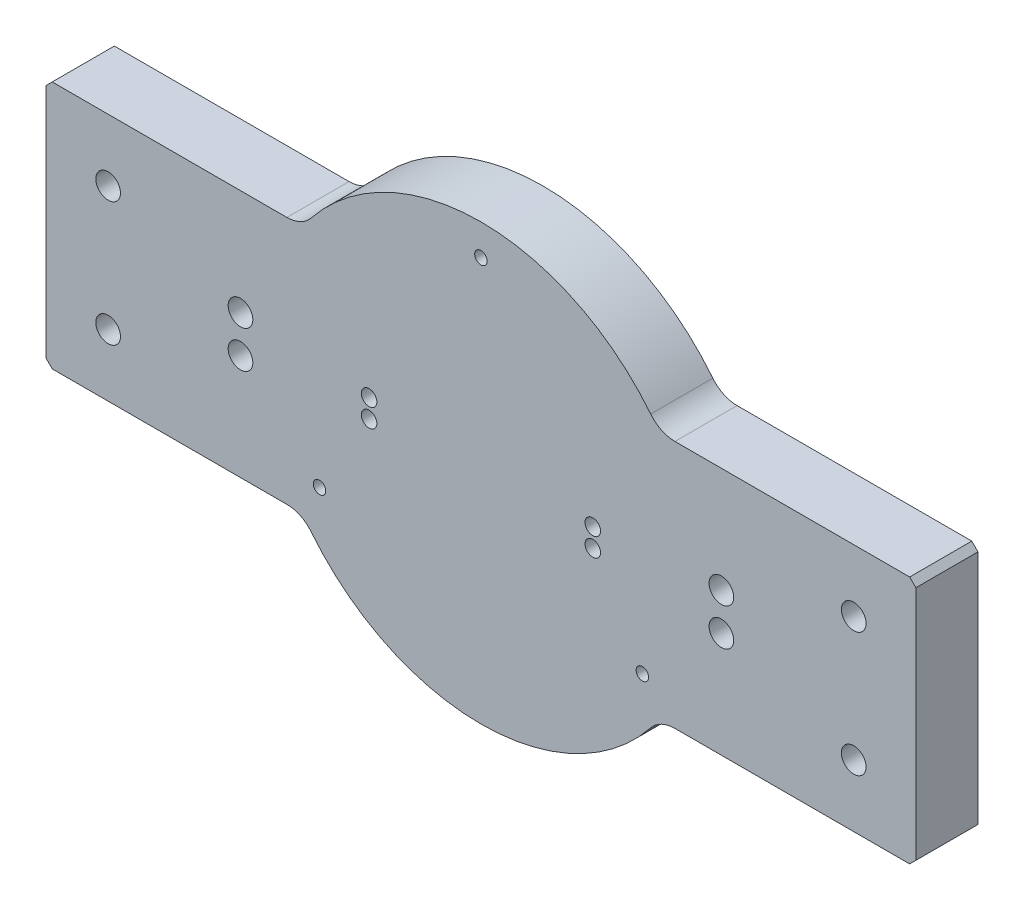
ISO-10303-21;
HEADER;
FILE_DESCRIPTION(('STEP AP214'),'2;1');
FILE_NAME('part.step','',(''),(''),'','','');
FILE_SCHEMA(('AUTOMOTIVE_DESIGN { 1 0 10303 214 1 1 1 1 }'));
ENDSEC;
DATA;
#1=APPLICATION_CONTEXT('core data for automotive mechanical design processes');
#2=APPLICATION_PROTOCOL_DEFINITION('international standard','automotive_design',2000,#1);
#3=PRODUCT_CONTEXT('',#1,'mechanical');
#4=PRODUCT('Part','Part','',(#3));
#5=PRODUCT_RELATED_PRODUCT_CATEGORY('part','',(#4));
#6=PRODUCT_DEFINITION_FORMATION('','',#4);
#7=PRODUCT_DEFINITION_CONTEXT('part definition',#1,'design');
#8=PRODUCT_DEFINITION('design','',#6,#7);
#9=PRODUCT_DEFINITION_SHAPE('','',#8);
#10=(LENGTH_UNIT() NAMED_UNIT(*) SI_UNIT(.MILLI.,.METRE.));
#11=(NAMED_UNIT(*) PLANE_ANGLE_UNIT() SI_UNIT($,.RADIAN.));
#12=(NAMED_UNIT(*) SI_UNIT($,.STERADIAN.) SOLID_ANGLE_UNIT());
#13=UNCERTAINTY_MEASURE_WITH_UNIT(LENGTH_MEASURE(1.E-05),#10,'distance_accuracy_value','');
#14=(GEOMETRIC_REPRESENTATION_CONTEXT(3) GLOBAL_UNCERTAINTY_ASSIGNED_CONTEXT((#13)) GLOBAL_UNIT_ASSIGNED_CONTEXT((#10,
#11,#12)) REPRESENTATION_CONTEXT('',''));
#15=CARTESIAN_POINT('',(0.,0.,0.));
#16=DIRECTION('',(0.,0.,1.));
#17=DIRECTION('',(1.,0.,0.));
#18=AXIS2_PLACEMENT_3D('',#15,#16,#17);
#19=CARTESIAN_POINT('',(177.8,50.8,25.4));
#20=DIRECTION('',(0.,0.,-1.));
#21=DIRECTION('',(-1.,0.,0.));
#22=AXIS2_PLACEMENT_3D('',#19,#20,#21);
#23=PLANE('',#22);
#24=CARTESIAN_POINT('',(45.72,-3.81,25.4));
#25=DIRECTION('',(0.,0.,1.));
#26=DIRECTION('',(1.,0.,0.));
#27=AXIS2_PLACEMENT_3D('',#24,#25,#26);
#28=CIRCLE('',#27,3.175);
#29=CARTESIAN_POINT('',(48.895,-3.81,25.4));
#30=VERTEX_POINT('',#29);
#31=EDGE_CURVE('E446',#30,#30,#28,.T.);
#32=ORIENTED_EDGE('',*,*,#31,.F.);
#33=EDGE_LOOP('',(#32));
#34=FACE_BOUND('',#33,.T.);
#35=CARTESIAN_POINT('',(45.72,3.81,25.4));
#36=DIRECTION('',(0.,0.,1.));
#37=DIRECTION('',(1.,0.,0.));
#38=AXIS2_PLACEMENT_3D('',#35,#36,#37);
#39=CIRCLE('',#38,3.175);
#40=CARTESIAN_POINT('',(48.895,3.81,25.4));
#41=VERTEX_POINT('',#40);
#42=EDGE_CURVE('E443',#41,#41,#39,.T.);
#43=ORIENTED_EDGE('',*,*,#42,.F.);
#44=EDGE_LOOP('',(#43));
#45=FACE_BOUND('',#44,.T.);
#46=CARTESIAN_POINT('',(152.399999999999,25.4,25.4));
#47=DIRECTION('',(0.,0.,1.));
#48=DIRECTION('',(1.,0.,0.));
#49=AXIS2_PLACEMENT_3D('',#46,#47,#48);
#50=CIRCLE('',#49,5.04189999999999);
#51=CARTESIAN_POINT('',(157.441899999999,25.4,25.4));
#52=VERTEX_POINT('',#51);
#53=EDGE_CURVE('E431',#52,#52,#50,.T.);
#54=ORIENTED_EDGE('',*,*,#53,.F.);
#55=EDGE_LOOP('',(#54));
#56=FACE_BOUND('',#55,.T.);
#57=CARTESIAN_POINT('',(-98.2979999999999,-7.62000000000009,25.4));
#58=DIRECTION('',(0.,0.,1.));
#59=DIRECTION('',(1.,0.,0.));
#60=AXIS2_PLACEMENT_3D('',#57,#58,#59);
#61=CIRCLE('',#60,5.04189999999999);
#62=CARTESIAN_POINT('',(-93.2560999999999,-7.62000000000009,25.4));
#63=VERTEX_POINT('',#62);
#64=EDGE_CURVE('E267',#63,#63,#61,.T.);
#65=ORIENTED_EDGE('',*,*,#64,.F.);
#66=EDGE_LOOP('',(#65));
#67=FACE_BOUND('',#66,.T.);
#68=CARTESIAN_POINT('',(-98.2979999999999,7.61999999999991,25.4));
#69=DIRECTION('',(0.,0.,1.));
#70=DIRECTION('',(1.,0.,0.));
#71=AXIS2_PLACEMENT_3D('',#68,#69,#70);
#72=CIRCLE('',#71,5.04189999999999);
#73=CARTESIAN_POINT('',(-93.2560999999999,7.61999999999991,25.4));
#74=VERTEX_POINT('',#73);
#75=EDGE_CURVE('E260',#74,#74,#72,.T.);
#76=ORIENTED_EDGE('',*,*,#75,.F.);
#77=EDGE_LOOP('',(#76));
#78=FACE_BOUND('',#77,.T.);
#79=DIRECTION('',(1.,0.,0.));
#80=VECTOR('',#79,1.);
#81=CARTESIAN_POINT('',(-177.8,-50.8,25.4));
#82=LINE('',#81,#80);
#83=CARTESIAN_POINT('',(79.3114745796596,-50.8,25.4));
#84=VERTEX_POINT('',#83);
#85=CARTESIAN_POINT('',(175.26,-50.8,25.4));
#86=VERTEX_POINT('',#85);
#87=EDGE_CURVE('E368',#84,#86,#82,.T.);
#88=ORIENTED_EDGE('',*,*,#87,.T.);
#89=DIRECTION('',(-0.707106781186548,-0.707106781186548,0.));
#90=VECTOR('',#89,1.);
#91=CARTESIAN_POINT('',(177.8,-48.26,25.4));
#92=LINE('',#91,#90);
#93=CARTESIAN_POINT('',(177.8,-48.26,25.4));
#94=VERTEX_POINT('',#93);
#95=EDGE_CURVE('E228',#86,#94,#92,.F.);
#96=ORIENTED_EDGE('',*,*,#95,.T.);
#97=DIRECTION('',(0.,1.,0.));
#98=VECTOR('',#97,1.);
#99=CARTESIAN_POINT('',(177.8,-50.8,25.4));
#100=LINE('',#99,#98);
#101=CARTESIAN_POINT('',(177.8,48.26,25.4));
#102=VERTEX_POINT('',#101);
#103=EDGE_CURVE('E167',#94,#102,#100,.T.);
#104=ORIENTED_EDGE('',*,*,#103,.T.);
#105=DIRECTION('',(0.707106781186548,-0.707106781186548,0.));
#106=VECTOR('',#105,1.);
#107=CARTESIAN_POINT('',(175.26,50.8,25.4));
#108=LINE('',#107,#106);
#109=CARTESIAN_POINT('',(175.26,50.8,25.4));
#110=VERTEX_POINT('',#109);
#111=EDGE_CURVE('E223',#102,#110,#108,.F.);
#112=ORIENTED_EDGE('',*,*,#111,.T.);
#113=DIRECTION('',(-1.,0.,0.));
#114=VECTOR('',#113,1.);
#115=CARTESIAN_POINT('',(-177.8,50.8,25.4));
#116=LINE('',#115,#114);
#117=CARTESIAN_POINT('',(79.3114745796596,50.8,25.4));
#118=VERTEX_POINT('',#117);
#119=EDGE_CURVE('E166',#110,#118,#116,.T.);
#120=ORIENTED_EDGE('',*,*,#119,.T.);
#121=CARTESIAN_POINT('',(79.3114745796597,63.5,25.4));
#122=DIRECTION('',(0.,0.,-1.));
#123=DIRECTION('',(-1.,0.,0.));
#124=AXIS2_PLACEMENT_3D('',#121,#122,#123);
#125=CIRCLE('',#124,12.7);
#126=CARTESIAN_POINT('',(69.3975402572022,55.5625,25.4));
#127=VERTEX_POINT('',#126);
#128=EDGE_CURVE('E156',#118,#127,#125,.T.);
#129=ORIENTED_EDGE('',*,*,#128,.T.);
#130=CARTESIAN_POINT('',(0.,0.,25.4));
#131=DIRECTION('',(0.,0.,1.));
#132=DIRECTION('',(1.,0.,0.));
#133=AXIS2_PLACEMENT_3D('',#130,#131,#132);
#134=CIRCLE('',#133,88.9);
#135=CARTESIAN_POINT('',(-69.3975402572022,55.5625,25.4));
#136=VERTEX_POINT('',#135);
#137=EDGE_CURVE('E152',#127,#136,#134,.T.);
#138=ORIENTED_EDGE('',*,*,#137,.T.);
#139=CARTESIAN_POINT('',(-79.3114745796597,63.5,25.4));
#140=DIRECTION('',(0.,0.,-1.));
#141=DIRECTION('',(-1.,0.,0.));
#142=AXIS2_PLACEMENT_3D('',#139,#140,#141);
#143=CIRCLE('',#142,12.7);
#144=CARTESIAN_POINT('',(-79.3114745796597,50.8,25.4));
#145=VERTEX_POINT('',#144);
#146=EDGE_CURVE('E146',#136,#145,#143,.T.);
#147=ORIENTED_EDGE('',*,*,#146,.T.);
#148=CARTESIAN_POINT('',(-175.26,50.8,25.4));
#149=VERTEX_POINT('',#148);
#150=EDGE_CURVE('E150',#145,#149,#116,.T.);
#151=ORIENTED_EDGE('',*,*,#150,.T.);
#152=DIRECTION('',(0.707106781186548,0.707106781186548,0.));
#153=VECTOR('',#152,1.);
#154=CARTESIAN_POINT('',(-177.8,48.2599999999999,25.4));
#155=LINE('',#154,#153);
#156=CARTESIAN_POINT('',(-177.8,48.2599999999999,25.4));
#157=VERTEX_POINT('',#156);
#158=EDGE_CURVE('E54',#149,#157,#155,.F.);
#159=ORIENTED_EDGE('',*,*,#158,.T.);
#160=DIRECTION('',(0.,-1.,0.));
#161=VECTOR('',#160,1.);
#162=CARTESIAN_POINT('',(-177.8,-50.8,25.4));
#163=LINE('',#162,#161);
#164=CARTESIAN_POINT('',(-177.8,-48.2600000000001,25.4));
#165=VERTEX_POINT('',#164);
#166=EDGE_CURVE('E240',#157,#165,#163,.T.);
#167=ORIENTED_EDGE('',*,*,#166,.T.);
#168=DIRECTION('',(-0.707106781186548,0.707106781186548,0.));
#169=VECTOR('',#168,1.);
#170=CARTESIAN_POINT('',(-175.26,-50.8,25.4));
#171=LINE('',#170,#169);
#172=CARTESIAN_POINT('',(-175.26,-50.8,25.4));
#173=VERTEX_POINT('',#172);
#174=EDGE_CURVE('E226',#165,#173,#171,.F.);
#175=ORIENTED_EDGE('',*,*,#174,.T.);
#176=CARTESIAN_POINT('',(-79.3114745796597,-50.8,25.4));
#177=VERTEX_POINT('',#176);
#178=EDGE_CURVE('E261',#173,#177,#82,.T.);
#179=ORIENTED_EDGE('',*,*,#178,.T.);
#180=CARTESIAN_POINT('',(-79.3114745796597,-63.5,25.4));
#181=DIRECTION('',(0.,0.,-1.));
#182=DIRECTION('',(-1.,0.,0.));
#183=AXIS2_PLACEMENT_3D('',#180,#181,#182);
#184=CIRCLE('',#183,12.7);
#185=CARTESIAN_POINT('',(-69.3975402572022,-55.5625,25.4));
#186=VERTEX_POINT('',#185);
#187=EDGE_CURVE('E203',#177,#186,#184,.T.);
#188=ORIENTED_EDGE('',*,*,#187,.T.);
#189=CARTESIAN_POINT('',(69.3975402572022,-55.5625,25.4));
#190=VERTEX_POINT('',#189);
#191=EDGE_CURVE('E383',#186,#190,#134,.T.);
#192=ORIENTED_EDGE('',*,*,#191,.T.);
#193=CARTESIAN_POINT('',(79.3114745796597,-63.5,25.4));
#194=DIRECTION('',(0.,0.,-1.));
#195=DIRECTION('',(-1.,0.,0.));
#196=AXIS2_PLACEMENT_3D('',#193,#194,#195);
#197=CIRCLE('',#196,12.7);
#198=EDGE_CURVE('E201',#190,#84,#197,.T.);
#199=ORIENTED_EDGE('',*,*,#198,.T.);
#200=EDGE_LOOP('',(#88,#96,#104,#112,#120,#129,#138,#147,#151,#159,#167,#175,#179,#188,#192,#199));
#201=FACE_BOUND('',#200,.T.);
#202=CARTESIAN_POINT('',(0.,76.2,25.4));
#203=DIRECTION('',(0.,0.,-1.));
#204=DIRECTION('',(-1.,0.,0.));
#205=AXIS2_PLACEMENT_3D('',#202,#203,#204);
#206=CIRCLE('',#205,2.55269999999999);
#207=CARTESIAN_POINT('',(-2.55269999999999,76.2,25.4));
#208=VERTEX_POINT('',#207);
#209=EDGE_CURVE('E386',#208,#208,#206,.T.);
#210=ORIENTED_EDGE('',*,*,#209,.T.);
#211=EDGE_LOOP('',(#210));
#212=FACE_BOUND('',#211,.T.);
#213=CARTESIAN_POINT('',(-65.9911357683741,-38.1000000000003,25.4));
#214=DIRECTION('',(0.,0.,-1.));
#215=DIRECTION('',(-1.,0.,0.));
#216=AXIS2_PLACEMENT_3D('',#213,#214,#215);
#217=CIRCLE('',#216,2.55269999999999);
#218=CARTESIAN_POINT('',(-68.5438357683741,-38.1000000000003,25.4));
#219=VERTEX_POINT('',#218);
#220=EDGE_CURVE('E392',#219,#219,#217,.T.);
#221=ORIENTED_EDGE('',*,*,#220,.T.);
#222=EDGE_LOOP('',(#221));
#223=FACE_BOUND('',#222,.T.);
#224=CARTESIAN_POINT('',(65.9911357683746,-38.0999999999994,25.4));
#225=DIRECTION('',(0.,0.,-1.));
#226=DIRECTION('',(-1.,0.,0.));
#227=AXIS2_PLACEMENT_3D('',#224,#225,#226);
#228=CIRCLE('',#227,2.55269999999999);
#229=CARTESIAN_POINT('',(63.4384357683746,-38.0999999999994,25.4));
#230=VERTEX_POINT('',#229);
#231=EDGE_CURVE('E398',#230,#230,#228,.T.);
#232=ORIENTED_EDGE('',*,*,#231,.T.);
#233=EDGE_LOOP('',(#232));
#234=FACE_BOUND('',#233,.T.);
#235=CARTESIAN_POINT('',(98.2980000000001,7.61999999999991,25.4));
#236=DIRECTION('',(0.,0.,1.));
#237=DIRECTION('',(1.,0.,0.));
#238=AXIS2_PLACEMENT_3D('',#235,#236,#237);
#239=CIRCLE('',#238,5.04189999999999);
#240=CARTESIAN_POINT('',(103.3399,7.61999999999991,25.4));
#241=VERTEX_POINT('',#240);
#242=EDGE_CURVE('E407',#241,#241,#239,.T.);
#243=ORIENTED_EDGE('',*,*,#242,.F.);
#244=EDGE_LOOP('',(#243));
#245=FACE_BOUND('',#244,.T.);
#246=CARTESIAN_POINT('',(98.2980000000001,-7.62000000000009,25.4));
#247=DIRECTION('',(0.,0.,1.));
#248=DIRECTION('',(1.,0.,0.));
#249=AXIS2_PLACEMENT_3D('',#246,#247,#248);
#250=CIRCLE('',#249,5.04189999999999);
#251=CARTESIAN_POINT('',(103.3399,-7.62000000000009,25.4));
#252=VERTEX_POINT('',#251);
#253=EDGE_CURVE('E410',#252,#252,#250,.T.);
#254=ORIENTED_EDGE('',*,*,#253,.F.);
#255=EDGE_LOOP('',(#254));
#256=FACE_BOUND('',#255,.T.);
#257=CARTESIAN_POINT('',(-152.4,25.4,25.4));
#258=DIRECTION('',(0.,0.,1.));
#259=DIRECTION('',(1.,0.,0.));
#260=AXIS2_PLACEMENT_3D('',#257,#258,#259);
#261=CIRCLE('',#260,5.04189999999999);
#262=CARTESIAN_POINT('',(-147.3581,25.4,25.4));
#263=VERTEX_POINT('',#262);
#264=EDGE_CURVE('E419',#263,#263,#261,.T.);
#265=ORIENTED_EDGE('',*,*,#264,.F.);
#266=EDGE_LOOP('',(#265));
#267=FACE_BOUND('',#266,.T.);
#268=CARTESIAN_POINT('',(-152.4,-25.4,25.4));
#269=DIRECTION('',(0.,0.,1.));
#270=DIRECTION('',(1.,0.,0.));
#271=AXIS2_PLACEMENT_3D('',#268,#269,#270);
#272=CIRCLE('',#271,5.04189999999999);
#273=CARTESIAN_POINT('',(-147.3581,-25.4,25.4));
#274=VERTEX_POINT('',#273);
#275=EDGE_CURVE('E425',#274,#274,#272,.T.);
#276=ORIENTED_EDGE('',*,*,#275,.F.);
#277=EDGE_LOOP('',(#276));
#278=FACE_BOUND('',#277,.T.);
#279=CARTESIAN_POINT('',(152.399999999999,-25.4,25.4));
#280=DIRECTION('',(0.,0.,1.));
#281=DIRECTION('',(1.,0.,0.));
#282=AXIS2_PLACEMENT_3D('',#279,#280,#281);
#283=CIRCLE('',#282,5.04189999999999);
#284=CARTESIAN_POINT('',(157.441899999999,-25.4,25.4));
#285=VERTEX_POINT('',#284);
#286=EDGE_CURVE('E437',#285,#285,#283,.T.);
#287=ORIENTED_EDGE('',*,*,#286,.F.);
#288=EDGE_LOOP('',(#287));
#289=FACE_BOUND('',#288,.T.);
#290=CARTESIAN_POINT('',(-45.72,3.81,25.4));
#291=DIRECTION('',(0.,0.,1.));
#292=DIRECTION('',(1.,0.,0.));
#293=AXIS2_PLACEMENT_3D('',#290,#291,#292);
#294=CIRCLE('',#293,3.175);
#295=CARTESIAN_POINT('',(-42.545,3.81,25.4));
#296=VERTEX_POINT('',#295);
#297=EDGE_CURVE('E273',#296,#296,#294,.T.);
#298=ORIENTED_EDGE('',*,*,#297,.F.);
#299=EDGE_LOOP('',(#298));
#300=FACE_BOUND('',#299,.T.);
#301=CARTESIAN_POINT('',(-45.72,-3.81,25.4));
#302=DIRECTION('',(0.,0.,1.));
#303=DIRECTION('',(1.,0.,0.));
#304=AXIS2_PLACEMENT_3D('',#301,#302,#303);
#305=CIRCLE('',#304,3.175);
#306=CARTESIAN_POINT('',(-42.545,-3.81,25.4));
#307=VERTEX_POINT('',#306);
#308=EDGE_CURVE('E171',#307,#307,#305,.T.);
#309=ORIENTED_EDGE('',*,*,#308,.F.);
#310=EDGE_LOOP('',(#309));
#311=FACE_BOUND('',#310,.T.);
#312=ADVANCED_FACE('F32',(#34,#45,#56,#67,#78,#201,#212,#223,#234,#245,#256,#267,#278,#289,#300,
#311),#23,.F.);
#313=CARTESIAN_POINT('',(177.8,50.8,0.));
#314=DIRECTION('',(0.,0.,-1.));
#315=DIRECTION('',(-1.,0.,0.));
#316=AXIS2_PLACEMENT_3D('',#313,#314,#315);
#317=PLANE('',#316);
#318=CARTESIAN_POINT('',(45.72,-3.81,0.));
#319=DIRECTION('',(0.,0.,1.));
#320=DIRECTION('',(1.,0.,0.));
#321=AXIS2_PLACEMENT_3D('',#318,#319,#320);
#322=CIRCLE('',#321,3.175);
#323=CARTESIAN_POINT('',(48.895,-3.81,0.));
#324=VERTEX_POINT('',#323);
#325=EDGE_CURVE('E449',#324,#324,#322,.T.);
#326=ORIENTED_EDGE('',*,*,#325,.T.);
#327=EDGE_LOOP('',(#326));
#328=FACE_BOUND('',#327,.T.);
#329=CARTESIAN_POINT('',(45.72,3.81,0.));
#330=DIRECTION('',(0.,0.,1.));
#331=DIRECTION('',(1.,0.,0.));
#332=AXIS2_PLACEMENT_3D('',#329,#330,#331);
#333=CIRCLE('',#332,3.175);
#334=CARTESIAN_POINT('',(48.895,3.81,0.));
#335=VERTEX_POINT('',#334);
#336=EDGE_CURVE('E440',#335,#335,#333,.T.);
#337=ORIENTED_EDGE('',*,*,#336,.T.);
#338=EDGE_LOOP('',(#337));
#339=FACE_BOUND('',#338,.T.);
#340=CARTESIAN_POINT('',(152.399999999999,25.4,0.));
#341=DIRECTION('',(0.,0.,1.));
#342=DIRECTION('',(1.,0.,0.));
#343=AXIS2_PLACEMENT_3D('',#340,#341,#342);
#344=CIRCLE('',#343,5.04189999999999);
#345=CARTESIAN_POINT('',(157.441899999999,25.4,0.));
#346=VERTEX_POINT('',#345);
#347=EDGE_CURVE('E428',#346,#346,#344,.T.);
#348=ORIENTED_EDGE('',*,*,#347,.T.);
#349=EDGE_LOOP('',(#348));
#350=FACE_BOUND('',#349,.T.);
#351=CARTESIAN_POINT('',(-98.2979999999999,-7.62000000000009,0.));
#352=DIRECTION('',(0.,0.,1.));
#353=DIRECTION('',(1.,0.,0.));
#354=AXIS2_PLACEMENT_3D('',#351,#352,#353);
#355=CIRCLE('',#354,5.04189999999999);
#356=CARTESIAN_POINT('',(-93.2560999999999,-7.62000000000009,0.));
#357=VERTEX_POINT('',#356);
#358=EDGE_CURVE('E264',#357,#357,#355,.T.);
#359=ORIENTED_EDGE('',*,*,#358,.T.);
#360=EDGE_LOOP('',(#359));
#361=FACE_BOUND('',#360,.T.);
#362=CARTESIAN_POINT('',(-98.2979999999999,7.61999999999991,0.));
#363=DIRECTION('',(0.,0.,1.));
#364=DIRECTION('',(1.,0.,0.));
#365=AXIS2_PLACEMENT_3D('',#362,#363,#364);
#366=CIRCLE('',#365,5.04189999999999);
#367=CARTESIAN_POINT('',(-93.2560999999999,7.61999999999991,0.));
#368=VERTEX_POINT('',#367);
#369=EDGE_CURVE('E257',#368,#368,#366,.T.);
#370=ORIENTED_EDGE('',*,*,#369,.T.);
#371=EDGE_LOOP('',(#370));
#372=FACE_BOUND('',#371,.T.);
#373=DIRECTION('',(0.,1.,0.));
#374=VECTOR('',#373,1.);
#375=CARTESIAN_POINT('',(177.8,-50.8,0.));
#376=LINE('',#375,#374);
#377=CARTESIAN_POINT('',(177.8,-48.26,0.));
#378=VERTEX_POINT('',#377);
#379=CARTESIAN_POINT('',(177.8,48.2600000000001,0.));
#380=VERTEX_POINT('',#379);
#381=EDGE_CURVE('E373',#378,#380,#376,.T.);
#382=ORIENTED_EDGE('',*,*,#381,.F.);
#383=DIRECTION('',(0.707106781186548,0.707106781186548,0.));
#384=VECTOR('',#383,1.);
#385=CARTESIAN_POINT('',(227.33,1.26999999999999,0.));
#386=LINE('',#385,#384);
#387=CARTESIAN_POINT('',(175.26,-50.8,0.));
#388=VERTEX_POINT('',#387);
#389=EDGE_CURVE('E219',#378,#388,#386,.F.);
#390=ORIENTED_EDGE('',*,*,#389,.T.);
#391=DIRECTION('',(1.,0.,0.));
#392=VECTOR('',#391,1.);
#393=CARTESIAN_POINT('',(-177.8,-50.8,0.));
#394=LINE('',#393,#392);
#395=CARTESIAN_POINT('',(79.3114745796596,-50.8,0.));
#396=VERTEX_POINT('',#395);
#397=EDGE_CURVE('E247',#396,#388,#394,.T.);
#398=ORIENTED_EDGE('',*,*,#397,.F.);
#399=CARTESIAN_POINT('',(79.3114745796597,-63.5,0.));
#400=DIRECTION('',(0.,0.,-1.));
#401=DIRECTION('',(-1.,0.,0.));
#402=AXIS2_PLACEMENT_3D('',#399,#400,#401);
#403=CIRCLE('',#402,12.7);
#404=CARTESIAN_POINT('',(69.3975402572022,-55.5625,0.));
#405=VERTEX_POINT('',#404);
#406=EDGE_CURVE('E199',#396,#405,#403,.F.);
#407=ORIENTED_EDGE('',*,*,#406,.T.);
#408=CARTESIAN_POINT('',(0.,0.,0.));
#409=DIRECTION('',(0.,0.,-1.));
#410=DIRECTION('',(-1.,0.,0.));
#411=AXIS2_PLACEMENT_3D('',#408,#409,#410);
#412=CIRCLE('',#411,88.9);
#413=CARTESIAN_POINT('',(-69.3975402572022,-55.5625,0.));
#414=VERTEX_POINT('',#413);
#415=EDGE_CURVE('E375',#414,#405,#412,.F.);
#416=ORIENTED_EDGE('',*,*,#415,.F.);
#417=CARTESIAN_POINT('',(-79.3114745796597,-63.5,0.));
#418=DIRECTION('',(0.,0.,-1.));
#419=DIRECTION('',(-1.,0.,0.));
#420=AXIS2_PLACEMENT_3D('',#417,#418,#419);
#421=CIRCLE('',#420,12.7);
#422=CARTESIAN_POINT('',(-79.3114745796597,-50.8,0.));
#423=VERTEX_POINT('',#422);
#424=EDGE_CURVE('E205',#414,#423,#421,.F.);
#425=ORIENTED_EDGE('',*,*,#424,.T.);
#426=CARTESIAN_POINT('',(-175.26,-50.8,0.));
#427=VERTEX_POINT('',#426);
#428=EDGE_CURVE('E251',#427,#423,#394,.T.);
#429=ORIENTED_EDGE('',*,*,#428,.F.);
#430=DIRECTION('',(0.707106781186548,-0.707106781186548,0.));
#431=VECTOR('',#430,1.);
#432=CARTESIAN_POINT('',(-49.5300000000001,-176.53,0.));
#433=LINE('',#432,#431);
#434=CARTESIAN_POINT('',(-177.8,-48.2600000000001,0.));
#435=VERTEX_POINT('',#434);
#436=EDGE_CURVE('E217',#427,#435,#433,.F.);
#437=ORIENTED_EDGE('',*,*,#436,.T.);
#438=DIRECTION('',(0.,-1.,0.));
#439=VECTOR('',#438,1.);
#440=CARTESIAN_POINT('',(-177.8,-50.8,0.));
#441=LINE('',#440,#439);
#442=CARTESIAN_POINT('',(-177.8,48.2599999999998,0.));
#443=VERTEX_POINT('',#442);
#444=EDGE_CURVE('E239',#443,#435,#441,.T.);
#445=ORIENTED_EDGE('',*,*,#444,.F.);
#446=DIRECTION('',(-0.707106781186548,-0.707106781186548,0.));
#447=VECTOR('',#446,1.);
#448=CARTESIAN_POINT('',(1.26999999999997,227.33,0.));
#449=LINE('',#448,#447);
#450=CARTESIAN_POINT('',(-175.26,50.8,0.));
#451=VERTEX_POINT('',#450);
#452=EDGE_CURVE('E215',#443,#451,#449,.F.);
#453=ORIENTED_EDGE('',*,*,#452,.T.);
#454=DIRECTION('',(-1.,0.,0.));
#455=VECTOR('',#454,1.);
#456=CARTESIAN_POINT('',(-177.8,50.8,0.));
#457=LINE('',#456,#455);
#458=CARTESIAN_POINT('',(-79.3114745796597,50.8,0.));
#459=VERTEX_POINT('',#458);
#460=EDGE_CURVE('E253',#459,#451,#457,.T.);
#461=ORIENTED_EDGE('',*,*,#460,.F.);
#462=CARTESIAN_POINT('',(-79.3114745796597,63.5,0.));
#463=DIRECTION('',(0.,0.,-1.));
#464=DIRECTION('',(-1.,0.,0.));
#465=AXIS2_PLACEMENT_3D('',#462,#463,#464);
#466=CIRCLE('',#465,12.7);
#467=CARTESIAN_POINT('',(-69.3975402572022,55.5625,0.));
#468=VERTEX_POINT('',#467);
#469=EDGE_CURVE('E157',#459,#468,#466,.F.);
#470=ORIENTED_EDGE('',*,*,#469,.T.);
#471=CARTESIAN_POINT('',(69.3975402572022,55.5625,0.));
#472=VERTEX_POINT('',#471);
#473=EDGE_CURVE('E377',#472,#468,#412,.F.);
#474=ORIENTED_EDGE('',*,*,#473,.F.);
#475=CARTESIAN_POINT('',(79.3114745796597,63.5,0.));
#476=DIRECTION('',(0.,0.,-1.));
#477=DIRECTION('',(-1.,0.,0.));
#478=AXIS2_PLACEMENT_3D('',#475,#476,#477);
#479=CIRCLE('',#478,12.7);
#480=CARTESIAN_POINT('',(79.3114745796596,50.8,0.));
#481=VERTEX_POINT('',#480);
#482=EDGE_CURVE('E196',#472,#481,#479,.F.);
#483=ORIENTED_EDGE('',*,*,#482,.T.);
#484=CARTESIAN_POINT('',(175.26,50.8,0.));
#485=VERTEX_POINT('',#484);
#486=EDGE_CURVE('E248',#485,#481,#457,.T.);
#487=ORIENTED_EDGE('',*,*,#486,.F.);
#488=DIRECTION('',(-0.707106781186548,0.707106781186548,0.));
#489=VECTOR('',#488,1.);
#490=CARTESIAN_POINT('',(176.53,49.53,0.));
#491=LINE('',#490,#489);
#492=EDGE_CURVE('E213',#485,#380,#491,.F.);
#493=ORIENTED_EDGE('',*,*,#492,.T.);
#494=EDGE_LOOP('',(#382,#390,#398,#407,#416,#425,#429,#437,#445,#453,#461,#470,#474,#483,#487,#493));
#495=FACE_BOUND('',#494,.T.);
#496=CARTESIAN_POINT('',(0.,76.2,0.));
#497=DIRECTION('',(0.,0.,-1.));
#498=DIRECTION('',(-1.,0.,0.));
#499=AXIS2_PLACEMENT_3D('',#496,#497,#498);
#500=CIRCLE('',#499,2.5527);
#501=CARTESIAN_POINT('',(-2.5527,76.2,0.));
#502=VERTEX_POINT('',#501);
#503=EDGE_CURVE('E389',#502,#502,#500,.T.);
#504=ORIENTED_EDGE('',*,*,#503,.F.);
#505=EDGE_LOOP('',(#504));
#506=FACE_BOUND('',#505,.T.);
#507=CARTESIAN_POINT('',(-65.9911357683741,-38.1000000000003,0.));
#508=DIRECTION('',(0.,0.,-1.));
#509=DIRECTION('',(-1.,0.,0.));
#510=AXIS2_PLACEMENT_3D('',#507,#508,#509);
#511=CIRCLE('',#510,2.55269999999999);
#512=CARTESIAN_POINT('',(-68.5438357683741,-38.1000000000003,0.));
#513=VERTEX_POINT('',#512);
#514=EDGE_CURVE('E395',#513,#513,#511,.T.);
#515=ORIENTED_EDGE('',*,*,#514,.F.);
#516=EDGE_LOOP('',(#515));
#517=FACE_BOUND('',#516,.T.);
#518=CARTESIAN_POINT('',(65.9911357683746,-38.0999999999994,0.));
#519=DIRECTION('',(0.,0.,-1.));
#520=DIRECTION('',(-1.,0.,0.));
#521=AXIS2_PLACEMENT_3D('',#518,#519,#520);
#522=CIRCLE('',#521,2.55269999999999);
#523=CARTESIAN_POINT('',(63.4384357683746,-38.0999999999994,0.));
#524=VERTEX_POINT('',#523);
#525=EDGE_CURVE('E401',#524,#524,#522,.T.);
#526=ORIENTED_EDGE('',*,*,#525,.F.);
#527=EDGE_LOOP('',(#526));
#528=FACE_BOUND('',#527,.T.);
#529=CARTESIAN_POINT('',(98.2980000000001,7.61999999999991,0.));
#530=DIRECTION('',(0.,0.,1.));
#531=DIRECTION('',(1.,0.,0.));
#532=AXIS2_PLACEMENT_3D('',#529,#530,#531);
#533=CIRCLE('',#532,5.04189999999999);
#534=CARTESIAN_POINT('',(103.3399,7.61999999999991,0.));
#535=VERTEX_POINT('',#534);
#536=EDGE_CURVE('E404',#535,#535,#533,.T.);
#537=ORIENTED_EDGE('',*,*,#536,.T.);
#538=EDGE_LOOP('',(#537));
#539=FACE_BOUND('',#538,.T.);
#540=CARTESIAN_POINT('',(98.2980000000001,-7.62000000000009,0.));
#541=DIRECTION('',(0.,0.,1.));
#542=DIRECTION('',(1.,0.,0.));
#543=AXIS2_PLACEMENT_3D('',#540,#541,#542);
#544=CIRCLE('',#543,5.04189999999999);
#545=CARTESIAN_POINT('',(103.3399,-7.62000000000009,0.));
#546=VERTEX_POINT('',#545);
#547=EDGE_CURVE('E413',#546,#546,#544,.T.);
#548=ORIENTED_EDGE('',*,*,#547,.T.);
#549=EDGE_LOOP('',(#548));
#550=FACE_BOUND('',#549,.T.);
#551=CARTESIAN_POINT('',(-152.4,25.4,0.));
#552=DIRECTION('',(0.,0.,1.));
#553=DIRECTION('',(1.,0.,0.));
#554=AXIS2_PLACEMENT_3D('',#551,#552,#553);
#555=CIRCLE('',#554,5.04189999999999);
#556=CARTESIAN_POINT('',(-147.3581,25.4,0.));
#557=VERTEX_POINT('',#556);
#558=EDGE_CURVE('E416',#557,#557,#555,.T.);
#559=ORIENTED_EDGE('',*,*,#558,.T.);
#560=EDGE_LOOP('',(#559));
#561=FACE_BOUND('',#560,.T.);
#562=CARTESIAN_POINT('',(-152.4,-25.4,0.));
#563=DIRECTION('',(0.,0.,1.));
#564=DIRECTION('',(1.,0.,0.));
#565=AXIS2_PLACEMENT_3D('',#562,#563,#564);
#566=CIRCLE('',#565,5.04189999999999);
#567=CARTESIAN_POINT('',(-147.3581,-25.4,0.));
#568=VERTEX_POINT('',#567);
#569=EDGE_CURVE('E422',#568,#568,#566,.T.);
#570=ORIENTED_EDGE('',*,*,#569,.T.);
#571=EDGE_LOOP('',(#570));
#572=FACE_BOUND('',#571,.T.);
#573=CARTESIAN_POINT('',(152.399999999999,-25.4,0.));
#574=DIRECTION('',(0.,0.,1.));
#575=DIRECTION('',(1.,0.,0.));
#576=AXIS2_PLACEMENT_3D('',#573,#574,#575);
#577=CIRCLE('',#576,5.04189999999999);
#578=CARTESIAN_POINT('',(157.441899999999,-25.4,0.));
#579=VERTEX_POINT('',#578);
#580=EDGE_CURVE('E434',#579,#579,#577,.T.);
#581=ORIENTED_EDGE('',*,*,#580,.T.);
#582=EDGE_LOOP('',(#581));
#583=FACE_BOUND('',#582,.T.);
#584=CARTESIAN_POINT('',(-45.72,3.81,0.));
#585=DIRECTION('',(0.,0.,1.));
#586=DIRECTION('',(1.,0.,0.));
#587=AXIS2_PLACEMENT_3D('',#584,#585,#586);
#588=CIRCLE('',#587,3.175);
#589=CARTESIAN_POINT('',(-42.545,3.81,0.));
#590=VERTEX_POINT('',#589);
#591=EDGE_CURVE('E270',#590,#590,#588,.T.);
#592=ORIENTED_EDGE('',*,*,#591,.T.);
#593=EDGE_LOOP('',(#592));
#594=FACE_BOUND('',#593,.T.);
#595=CARTESIAN_POINT('',(-45.72,-3.81,0.));
#596=DIRECTION('',(0.,0.,1.));
#597=DIRECTION('',(1.,0.,0.));
#598=AXIS2_PLACEMENT_3D('',#595,#596,#597);
#599=CIRCLE('',#598,3.175);
#600=CARTESIAN_POINT('',(-42.545,-3.81,0.));
#601=VERTEX_POINT('',#600);
#602=EDGE_CURVE('E176',#601,#601,#599,.T.);
#603=ORIENTED_EDGE('',*,*,#602,.T.);
#604=EDGE_LOOP('',(#603));
#605=FACE_BOUND('',#604,.T.);
#606=ADVANCED_FACE('F244',(#328,#339,#350,#361,#372,#495,#506,#517,#528,#539,#550,#561,#572,
#583,#594,#605),#317,.T.);
#607=CARTESIAN_POINT('',(-177.8,50.8,25.4));
#608=DIRECTION('',(0.,-1.,0.));
#609=DIRECTION('',(0.,0.,-1.));
#610=AXIS2_PLACEMENT_3D('',#607,#608,#609);
#611=PLANE('',#610);
#612=ORIENTED_EDGE('',*,*,#119,.F.);
#613=DIRECTION('',(0.,0.,-1.));
#614=VECTOR('',#613,1.);
#615=CARTESIAN_POINT('',(175.26,50.8,25.4));
#616=LINE('',#615,#614);
#617=EDGE_CURVE('E11',#110,#485,#616,.T.);
#618=ORIENTED_EDGE('',*,*,#617,.T.);
#619=ORIENTED_EDGE('',*,*,#486,.T.);
#620=DIRECTION('',(0.,0.,1.));
#621=VECTOR('',#620,1.);
#622=CARTESIAN_POINT('',(79.3114745796596,50.8,25.4));
#623=LINE('',#622,#621);
#624=EDGE_CURVE('E181',#481,#118,#623,.T.);
#625=ORIENTED_EDGE('',*,*,#624,.T.);
#626=EDGE_LOOP('',(#612,#618,#619,#625));
#627=FACE_BOUND('',#626,.T.);
#628=ADVANCED_FACE('F292',(#627),#611,.F.);
#629=CARTESIAN_POINT('',(-177.8,-50.8,25.4));
#630=DIRECTION('',(0.,1.,0.));
#631=DIRECTION('',(0.,0.,1.));
#632=AXIS2_PLACEMENT_3D('',#629,#630,#631);
#633=PLANE('',#632);
#634=ORIENTED_EDGE('',*,*,#178,.F.);
#635=DIRECTION('',(0.,0.,-1.));
#636=VECTOR('',#635,1.);
#637=CARTESIAN_POINT('',(-175.26,-50.8,25.4));
#638=LINE('',#637,#636);
#639=EDGE_CURVE('E230',#173,#427,#638,.T.);
#640=ORIENTED_EDGE('',*,*,#639,.T.);
#641=ORIENTED_EDGE('',*,*,#428,.T.);
#642=DIRECTION('',(0.,0.,1.));
#643=VECTOR('',#642,1.);
#644=CARTESIAN_POINT('',(-79.3114745796597,-50.8,25.4));
#645=LINE('',#644,#643);
#646=EDGE_CURVE('E191',#423,#177,#645,.T.);
#647=ORIENTED_EDGE('',*,*,#646,.T.);
#648=EDGE_LOOP('',(#634,#640,#641,#647));
#649=FACE_BOUND('',#648,.T.);
#650=ADVANCED_FACE('F306',(#649),#633,.F.);
#651=CARTESIAN_POINT('',(177.8,-50.8,25.4));
#652=DIRECTION('',(-1.,0.,0.));
#653=DIRECTION('',(0.,0.,1.));
#654=AXIS2_PLACEMENT_3D('',#651,#652,#653);
#655=PLANE('',#654);
#656=ORIENTED_EDGE('',*,*,#103,.F.);
#657=DIRECTION('',(0.,0.,-1.));
#658=VECTOR('',#657,1.);
#659=CARTESIAN_POINT('',(177.8,-48.26,25.4));
#660=LINE('',#659,#658);
#661=EDGE_CURVE('E210',#94,#378,#660,.T.);
#662=ORIENTED_EDGE('',*,*,#661,.T.);
#663=ORIENTED_EDGE('',*,*,#381,.T.);
#664=DIRECTION('',(0.,0.,1.));
#665=VECTOR('',#664,1.);
#666=CARTESIAN_POINT('',(177.8,48.2600000000001,25.4));
#667=LINE('',#666,#665);
#668=EDGE_CURVE('E208',#380,#102,#667,.T.);
#669=ORIENTED_EDGE('',*,*,#668,.T.);
#670=EDGE_LOOP('',(#656,#662,#663,#669));
#671=FACE_BOUND('',#670,.T.);
#672=ADVANCED_FACE('F311',(#671),#655,.F.);
#673=ORIENTED_EDGE('',*,*,#460,.T.);
#674=DIRECTION('',(0.,0.,1.));
#675=VECTOR('',#674,1.);
#676=CARTESIAN_POINT('',(-175.26,50.8,25.4));
#677=LINE('',#676,#675);
#678=EDGE_CURVE('E40',#451,#149,#677,.T.);
#679=ORIENTED_EDGE('',*,*,#678,.T.);
#680=ORIENTED_EDGE('',*,*,#150,.F.);
#681=DIRECTION('',(0.,0.,1.));
#682=VECTOR('',#681,1.);
#683=CARTESIAN_POINT('',(-79.3114745796597,50.8,25.4));
#684=LINE('',#683,#682);
#685=EDGE_CURVE('E163',#145,#459,#684,.F.);
#686=ORIENTED_EDGE('',*,*,#685,.T.);
#687=EDGE_LOOP('',(#673,#679,#680,#686));
#688=FACE_BOUND('',#687,.T.);
#689=ADVANCED_FACE('F162',(#688),#611,.F.);
#690=CARTESIAN_POINT('',(-177.8,-50.8,25.4));
#691=DIRECTION('',(1.,0.,0.));
#692=DIRECTION('',(0.,0.,-1.));
#693=AXIS2_PLACEMENT_3D('',#690,#691,#692);
#694=PLANE('',#693);
#695=ORIENTED_EDGE('',*,*,#444,.T.);
#696=DIRECTION('',(0.,0.,1.));
#697=VECTOR('',#696,1.);
#698=CARTESIAN_POINT('',(-177.8,-48.2600000000001,25.4));
#699=LINE('',#698,#697);
#700=EDGE_CURVE('E47',#435,#165,#699,.T.);
#701=ORIENTED_EDGE('',*,*,#700,.T.);
#702=ORIENTED_EDGE('',*,*,#166,.F.);
#703=DIRECTION('',(0.,0.,-1.));
#704=VECTOR('',#703,1.);
#705=CARTESIAN_POINT('',(-177.8,48.2599999999999,25.4));
#706=LINE('',#705,#704);
#707=EDGE_CURVE('E233',#157,#443,#706,.T.);
#708=ORIENTED_EDGE('',*,*,#707,.T.);
#709=EDGE_LOOP('',(#695,#701,#702,#708));
#710=FACE_BOUND('',#709,.T.);
#711=ADVANCED_FACE('F238',(#710),#694,.F.);
#712=ORIENTED_EDGE('',*,*,#397,.T.);
#713=DIRECTION('',(0.,0.,1.));
#714=VECTOR('',#713,1.);
#715=CARTESIAN_POINT('',(175.26,-50.8,25.4));
#716=LINE('',#715,#714);
#717=EDGE_CURVE('E221',#388,#86,#716,.T.);
#718=ORIENTED_EDGE('',*,*,#717,.T.);
#719=ORIENTED_EDGE('',*,*,#87,.F.);
#720=DIRECTION('',(0.,0.,1.));
#721=VECTOR('',#720,1.);
#722=CARTESIAN_POINT('',(79.3114745796596,-50.8,25.4));
#723=LINE('',#722,#721);
#724=EDGE_CURVE('E184',#84,#396,#723,.F.);
#725=ORIENTED_EDGE('',*,*,#724,.T.);
#726=EDGE_LOOP('',(#712,#718,#719,#725));
#727=FACE_BOUND('',#726,.T.);
#728=ADVANCED_FACE('F301',(#727),#633,.F.);
#729=CARTESIAN_POINT('',(0.,0.,-251.447171389936));
#730=DIRECTION('',(0.,0.,1.));
#731=DIRECTION('',(1.,0.,0.));
#732=AXIS2_PLACEMENT_3D('',#729,#730,#731);
#733=CYLINDRICAL_SURFACE('',#732,88.9);
#734=ORIENTED_EDGE('',*,*,#415,.T.);
#735=DIRECTION('',(0.,0.,1.));
#736=VECTOR('',#735,1.);
#737=CARTESIAN_POINT('',(69.3975402572022,-55.5625,-251.447171389936));
#738=LINE('',#737,#736);
#739=EDGE_CURVE('E189',#405,#190,#738,.T.);
#740=ORIENTED_EDGE('',*,*,#739,.T.);
#741=ORIENTED_EDGE('',*,*,#191,.F.);
#742=DIRECTION('',(0.,0.,1.));
#743=VECTOR('',#742,1.);
#744=CARTESIAN_POINT('',(-69.3975402572022,-55.5625,-251.447171389936));
#745=LINE('',#744,#743);
#746=EDGE_CURVE('E187',#186,#414,#745,.F.);
#747=ORIENTED_EDGE('',*,*,#746,.T.);
#748=EDGE_LOOP('',(#734,#740,#741,#747));
#749=FACE_BOUND('',#748,.T.);
#750=ADVANCED_FACE('F304',(#749),#733,.T.);
#751=ORIENTED_EDGE('',*,*,#473,.T.);
#752=DIRECTION('',(0.,0.,1.));
#753=VECTOR('',#752,1.);
#754=CARTESIAN_POINT('',(-69.3975402572022,55.5625,-251.447171389936));
#755=LINE('',#754,#753);
#756=EDGE_CURVE('E173',#468,#136,#755,.T.);
#757=ORIENTED_EDGE('',*,*,#756,.T.);
#758=ORIENTED_EDGE('',*,*,#137,.F.);
#759=DIRECTION('',(0.,0.,1.));
#760=VECTOR('',#759,1.);
#761=CARTESIAN_POINT('',(69.3975402572022,55.5625,-251.447171389936));
#762=LINE('',#761,#760);
#763=EDGE_CURVE('E170',#127,#472,#762,.F.);
#764=ORIENTED_EDGE('',*,*,#763,.T.);
#765=EDGE_LOOP('',(#751,#757,#758,#764));
#766=FACE_BOUND('',#765,.T.);
#767=ADVANCED_FACE('F298',(#766),#733,.T.);
#768=CARTESIAN_POINT('',(0.,76.2,0.));
#769=DIRECTION('',(0.,0.,-1.));
#770=DIRECTION('',(-1.,0.,0.));
#771=AXIS2_PLACEMENT_3D('',#768,#769,#770);
#772=CYLINDRICAL_SURFACE('',#771,2.5527);
#773=ORIENTED_EDGE('',*,*,#209,.F.);
#774=EDGE_LOOP('',(#773));
#775=FACE_BOUND('',#774,.T.);
#776=ORIENTED_EDGE('',*,*,#503,.T.);
#777=EDGE_LOOP('',(#776));
#778=FACE_BOUND('',#777,.T.);
#779=ADVANCED_FACE('F492',(#775,#778),#772,.F.);
#780=CARTESIAN_POINT('',(-65.9911357683741,-38.1000000000003,0.));
#781=DIRECTION('',(0.,0.,-1.));
#782=DIRECTION('',(-1.,0.,0.));
#783=AXIS2_PLACEMENT_3D('',#780,#781,#782);
#784=CYLINDRICAL_SURFACE('',#783,2.55269999999999);
#785=ORIENTED_EDGE('',*,*,#220,.F.);
#786=EDGE_LOOP('',(#785));
#787=FACE_BOUND('',#786,.T.);
#788=ORIENTED_EDGE('',*,*,#514,.T.);
#789=EDGE_LOOP('',(#788));
#790=FACE_BOUND('',#789,.T.);
#791=ADVANCED_FACE('F489',(#787,#790),#784,.F.);
#792=CARTESIAN_POINT('',(65.9911357683746,-38.0999999999994,0.));
#793=DIRECTION('',(0.,0.,-1.));
#794=DIRECTION('',(-1.,0.,0.));
#795=AXIS2_PLACEMENT_3D('',#792,#793,#794);
#796=CYLINDRICAL_SURFACE('',#795,2.55269999999999);
#797=ORIENTED_EDGE('',*,*,#231,.F.);
#798=EDGE_LOOP('',(#797));
#799=FACE_BOUND('',#798,.T.);
#800=ORIENTED_EDGE('',*,*,#525,.T.);
#801=EDGE_LOOP('',(#800));
#802=FACE_BOUND('',#801,.T.);
#803=ADVANCED_FACE('F485',(#799,#802),#796,.F.);
#804=CARTESIAN_POINT('',(98.2980000000001,7.61999999999991,25.4));
#805=DIRECTION('',(0.,0.,1.));
#806=DIRECTION('',(1.,0.,0.));
#807=AXIS2_PLACEMENT_3D('',#804,#805,#806);
#808=CYLINDRICAL_SURFACE('',#807,5.04189999999999);
#809=ORIENTED_EDGE('',*,*,#536,.F.);
#810=EDGE_LOOP('',(#809));
#811=FACE_BOUND('',#810,.T.);
#812=ORIENTED_EDGE('',*,*,#242,.T.);
#813=EDGE_LOOP('',(#812));
#814=FACE_BOUND('',#813,.T.);
#815=ADVANCED_FACE('F481',(#811,#814),#808,.F.);
#816=CARTESIAN_POINT('',(98.2980000000001,-7.62000000000009,25.4));
#817=DIRECTION('',(0.,0.,1.));
#818=DIRECTION('',(1.,0.,0.));
#819=AXIS2_PLACEMENT_3D('',#816,#817,#818);
#820=CYLINDRICAL_SURFACE('',#819,5.04189999999999);
#821=ORIENTED_EDGE('',*,*,#547,.F.);
#822=EDGE_LOOP('',(#821));
#823=FACE_BOUND('',#822,.T.);
#824=ORIENTED_EDGE('',*,*,#253,.T.);
#825=EDGE_LOOP('',(#824));
#826=FACE_BOUND('',#825,.T.);
#827=ADVANCED_FACE('F319',(#823,#826),#820,.F.);
#828=CARTESIAN_POINT('',(-98.2979999999999,7.61999999999991,25.4));
#829=DIRECTION('',(0.,0.,1.));
#830=DIRECTION('',(1.,0.,0.));
#831=AXIS2_PLACEMENT_3D('',#828,#829,#830);
#832=CYLINDRICAL_SURFACE('',#831,5.04189999999999);
#833=ORIENTED_EDGE('',*,*,#369,.F.);
#834=EDGE_LOOP('',(#833));
#835=FACE_BOUND('',#834,.T.);
#836=ORIENTED_EDGE('',*,*,#75,.T.);
#837=EDGE_LOOP('',(#836));
#838=FACE_BOUND('',#837,.T.);
#839=ADVANCED_FACE('F315',(#835,#838),#832,.F.);
#840=CARTESIAN_POINT('',(-98.2979999999999,-7.62000000000009,25.4));
#841=DIRECTION('',(0.,0.,1.));
#842=DIRECTION('',(1.,0.,0.));
#843=AXIS2_PLACEMENT_3D('',#840,#841,#842);
#844=CYLINDRICAL_SURFACE('',#843,5.04189999999999);
#845=ORIENTED_EDGE('',*,*,#358,.F.);
#846=EDGE_LOOP('',(#845));
#847=FACE_BOUND('',#846,.T.);
#848=ORIENTED_EDGE('',*,*,#64,.T.);
#849=EDGE_LOOP('',(#848));
#850=FACE_BOUND('',#849,.T.);
#851=ADVANCED_FACE('F318',(#847,#850),#844,.F.);
#852=CARTESIAN_POINT('',(-152.4,25.4,25.4));
#853=DIRECTION('',(0.,0.,1.));
#854=DIRECTION('',(1.,0.,0.));
#855=AXIS2_PLACEMENT_3D('',#852,#853,#854);
#856=CYLINDRICAL_SURFACE('',#855,5.04189999999999);
#857=ORIENTED_EDGE('',*,*,#558,.F.);
#858=EDGE_LOOP('',(#857));
#859=FACE_BOUND('',#858,.T.);
#860=ORIENTED_EDGE('',*,*,#264,.T.);
#861=EDGE_LOOP('',(#860));
#862=FACE_BOUND('',#861,.T.);
#863=ADVANCED_FACE('F323',(#859,#862),#856,.F.);
#864=CARTESIAN_POINT('',(-152.4,-25.4,25.4));
#865=DIRECTION('',(0.,0.,1.));
#866=DIRECTION('',(1.,0.,0.));
#867=AXIS2_PLACEMENT_3D('',#864,#865,#866);
#868=CYLINDRICAL_SURFACE('',#867,5.04189999999999);
#869=ORIENTED_EDGE('',*,*,#569,.F.);
#870=EDGE_LOOP('',(#869));
#871=FACE_BOUND('',#870,.T.);
#872=ORIENTED_EDGE('',*,*,#275,.T.);
#873=EDGE_LOOP('',(#872));
#874=FACE_BOUND('',#873,.T.);
#875=ADVANCED_FACE('F471',(#871,#874),#868,.F.);
#876=CARTESIAN_POINT('',(152.399999999999,25.4,25.4));
#877=DIRECTION('',(0.,0.,1.));
#878=DIRECTION('',(1.,0.,0.));
#879=AXIS2_PLACEMENT_3D('',#876,#877,#878);
#880=CYLINDRICAL_SURFACE('',#879,5.04189999999999);
#881=ORIENTED_EDGE('',*,*,#347,.F.);
#882=EDGE_LOOP('',(#881));
#883=FACE_BOUND('',#882,.T.);
#884=ORIENTED_EDGE('',*,*,#53,.T.);
#885=EDGE_LOOP('',(#884));
#886=FACE_BOUND('',#885,.T.);
#887=ADVANCED_FACE('F467',(#883,#886),#880,.F.);
#888=CARTESIAN_POINT('',(152.399999999999,-25.4,25.4));
#889=DIRECTION('',(0.,0.,1.));
#890=DIRECTION('',(1.,0.,0.));
#891=AXIS2_PLACEMENT_3D('',#888,#889,#890);
#892=CYLINDRICAL_SURFACE('',#891,5.04189999999999);
#893=ORIENTED_EDGE('',*,*,#580,.F.);
#894=EDGE_LOOP('',(#893));
#895=FACE_BOUND('',#894,.T.);
#896=ORIENTED_EDGE('',*,*,#286,.T.);
#897=EDGE_LOOP('',(#896));
#898=FACE_BOUND('',#897,.T.);
#899=ADVANCED_FACE('F461',(#895,#898),#892,.F.);
#900=CARTESIAN_POINT('',(45.72,3.81,25.4));
#901=DIRECTION('',(0.,0.,1.));
#902=DIRECTION('',(1.,0.,0.));
#903=AXIS2_PLACEMENT_3D('',#900,#901,#902);
#904=CYLINDRICAL_SURFACE('',#903,3.175);
#905=ORIENTED_EDGE('',*,*,#336,.F.);
#906=EDGE_LOOP('',(#905));
#907=FACE_BOUND('',#906,.T.);
#908=ORIENTED_EDGE('',*,*,#42,.T.);
#909=EDGE_LOOP('',(#908));
#910=FACE_BOUND('',#909,.T.);
#911=ADVANCED_FACE('F456',(#907,#910),#904,.F.);
#912=CARTESIAN_POINT('',(45.72,-3.81,25.4));
#913=DIRECTION('',(0.,0.,1.));
#914=DIRECTION('',(1.,0.,0.));
#915=AXIS2_PLACEMENT_3D('',#912,#913,#914);
#916=CYLINDRICAL_SURFACE('',#915,3.175);
#917=ORIENTED_EDGE('',*,*,#325,.F.);
#918=EDGE_LOOP('',(#917));
#919=FACE_BOUND('',#918,.T.);
#920=ORIENTED_EDGE('',*,*,#31,.T.);
#921=EDGE_LOOP('',(#920));
#922=FACE_BOUND('',#921,.T.);
#923=ADVANCED_FACE('F326',(#919,#922),#916,.F.);
#924=CARTESIAN_POINT('',(-45.72,3.81,25.4));
#925=DIRECTION('',(0.,0.,1.));
#926=DIRECTION('',(1.,0.,0.));
#927=AXIS2_PLACEMENT_3D('',#924,#925,#926);
#928=CYLINDRICAL_SURFACE('',#927,3.175);
#929=ORIENTED_EDGE('',*,*,#591,.F.);
#930=EDGE_LOOP('',(#929));
#931=FACE_BOUND('',#930,.T.);
#932=ORIENTED_EDGE('',*,*,#297,.T.);
#933=EDGE_LOOP('',(#932));
#934=FACE_BOUND('',#933,.T.);
#935=ADVANCED_FACE('F282',(#931,#934),#928,.F.);
#936=CARTESIAN_POINT('',(-45.72,-3.81,25.4));
#937=DIRECTION('',(0.,0.,1.));
#938=DIRECTION('',(1.,0.,0.));
#939=AXIS2_PLACEMENT_3D('',#936,#937,#938);
#940=CYLINDRICAL_SURFACE('',#939,3.175);
#941=ORIENTED_EDGE('',*,*,#602,.F.);
#942=EDGE_LOOP('',(#941));
#943=FACE_BOUND('',#942,.T.);
#944=ORIENTED_EDGE('',*,*,#308,.T.);
#945=EDGE_LOOP('',(#944));
#946=FACE_BOUND('',#945,.T.);
#947=ADVANCED_FACE('F279',(#943,#946),#940,.F.);
#948=CARTESIAN_POINT('',(-79.3114745796597,63.5,-251.447171389936));
#949=DIRECTION('',(0.,0.,1.));
#950=DIRECTION('',(1.,0.,0.));
#951=AXIS2_PLACEMENT_3D('',#948,#949,#950);
#952=CYLINDRICAL_SURFACE('',#951,12.7);
#953=ORIENTED_EDGE('',*,*,#146,.F.);
#954=ORIENTED_EDGE('',*,*,#756,.F.);
#955=ORIENTED_EDGE('',*,*,#469,.F.);
#956=ORIENTED_EDGE('',*,*,#685,.F.);
#957=EDGE_LOOP('',(#953,#954,#955,#956));
#958=FACE_BOUND('',#957,.T.);
#959=ADVANCED_FACE('F169',(#958),#952,.F.);
#960=CARTESIAN_POINT('',(79.3114745796597,63.5,-251.447171389936));
#961=DIRECTION('',(0.,0.,1.));
#962=DIRECTION('',(1.,0.,0.));
#963=AXIS2_PLACEMENT_3D('',#960,#961,#962);
#964=CYLINDRICAL_SURFACE('',#963,12.7);
#965=ORIENTED_EDGE('',*,*,#482,.F.);
#966=ORIENTED_EDGE('',*,*,#763,.F.);
#967=ORIENTED_EDGE('',*,*,#128,.F.);
#968=ORIENTED_EDGE('',*,*,#624,.F.);
#969=EDGE_LOOP('',(#965,#966,#967,#968));
#970=FACE_BOUND('',#969,.T.);
#971=ADVANCED_FACE('F331',(#970),#964,.F.);
#972=CARTESIAN_POINT('',(79.3114745796597,-63.5,-251.447171389936));
#973=DIRECTION('',(0.,0.,1.));
#974=DIRECTION('',(1.,0.,0.));
#975=AXIS2_PLACEMENT_3D('',#972,#973,#974);
#976=CYLINDRICAL_SURFACE('',#975,12.7);
#977=ORIENTED_EDGE('',*,*,#198,.F.);
#978=ORIENTED_EDGE('',*,*,#739,.F.);
#979=ORIENTED_EDGE('',*,*,#406,.F.);
#980=ORIENTED_EDGE('',*,*,#724,.F.);
#981=EDGE_LOOP('',(#977,#978,#979,#980));
#982=FACE_BOUND('',#981,.T.);
#983=ADVANCED_FACE('F334',(#982),#976,.F.);
#984=CARTESIAN_POINT('',(-79.3114745796597,-63.5,-251.447171389936));
#985=DIRECTION('',(0.,0.,1.));
#986=DIRECTION('',(1.,0.,0.));
#987=AXIS2_PLACEMENT_3D('',#984,#985,#986);
#988=CYLINDRICAL_SURFACE('',#987,12.7);
#989=ORIENTED_EDGE('',*,*,#424,.F.);
#990=ORIENTED_EDGE('',*,*,#746,.F.);
#991=ORIENTED_EDGE('',*,*,#187,.F.);
#992=ORIENTED_EDGE('',*,*,#646,.F.);
#993=EDGE_LOOP('',(#989,#990,#991,#992));
#994=FACE_BOUND('',#993,.T.);
#995=ADVANCED_FACE('F338',(#994),#988,.F.);
#996=CARTESIAN_POINT('',(177.8,-48.26,25.4));
#997=DIRECTION('',(-0.707106781186548,0.707106781186548,0.));
#998=DIRECTION('',(-0.707106781186548,-0.707106781186548,0.));
#999=AXIS2_PLACEMENT_3D('',#996,#997,#998);
#1000=PLANE('',#999);
#1001=ORIENTED_EDGE('',*,*,#95,.F.);
#1002=ORIENTED_EDGE('',*,*,#717,.F.);
#1003=ORIENTED_EDGE('',*,*,#389,.F.);
#1004=ORIENTED_EDGE('',*,*,#661,.F.);
#1005=EDGE_LOOP('',(#1001,#1002,#1003,#1004));
#1006=FACE_BOUND('',#1005,.T.);
#1007=ADVANCED_FACE('F342',(#1006),#1000,.F.);
#1008=CARTESIAN_POINT('',(-175.26,-50.8,25.4));
#1009=DIRECTION('',(0.707106781186548,0.707106781186548,0.));
#1010=DIRECTION('',(-0.707106781186548,0.707106781186548,0.));
#1011=AXIS2_PLACEMENT_3D('',#1008,#1009,#1010);
#1012=PLANE('',#1011);
#1013=ORIENTED_EDGE('',*,*,#174,.F.);
#1014=ORIENTED_EDGE('',*,*,#700,.F.);
#1015=ORIENTED_EDGE('',*,*,#436,.F.);
#1016=ORIENTED_EDGE('',*,*,#639,.F.);
#1017=EDGE_LOOP('',(#1013,#1014,#1015,#1016));
#1018=FACE_BOUND('',#1017,.T.);
#1019=ADVANCED_FACE('F346',(#1018),#1012,.F.);
#1020=CARTESIAN_POINT('',(-177.8,48.2599999999999,25.4));
#1021=DIRECTION('',(0.707106781186548,-0.707106781186548,0.));
#1022=DIRECTION('',(0.707106781186548,0.707106781186548,0.));
#1023=AXIS2_PLACEMENT_3D('',#1020,#1021,#1022);
#1024=PLANE('',#1023);
#1025=ORIENTED_EDGE('',*,*,#158,.F.);
#1026=ORIENTED_EDGE('',*,*,#678,.F.);
#1027=ORIENTED_EDGE('',*,*,#452,.F.);
#1028=ORIENTED_EDGE('',*,*,#707,.F.);
#1029=EDGE_LOOP('',(#1025,#1026,#1027,#1028));
#1030=FACE_BOUND('',#1029,.T.);
#1031=ADVANCED_FACE('F349',(#1030),#1024,.F.);
#1032=CARTESIAN_POINT('',(175.26,50.8,25.4));
#1033=DIRECTION('',(-0.707106781186548,-0.707106781186548,0.));
#1034=DIRECTION('',(0.707106781186548,-0.707106781186548,0.));
#1035=AXIS2_PLACEMENT_3D('',#1032,#1033,#1034);
#1036=PLANE('',#1035);
#1037=ORIENTED_EDGE('',*,*,#111,.F.);
#1038=ORIENTED_EDGE('',*,*,#668,.F.);
#1039=ORIENTED_EDGE('',*,*,#492,.F.);
#1040=ORIENTED_EDGE('',*,*,#617,.F.);
#1041=EDGE_LOOP('',(#1037,#1038,#1039,#1040));
#1042=FACE_BOUND('',#1041,.T.);
#1043=ADVANCED_FACE('F34',(#1042),#1036,.F.);
#1044=CLOSED_SHELL('',(#312,#606,#628,#650,#672,#689,#711,#728,#750,#767,#779,#791,#803,#815,
#827,#839,#851,#863,#875,#887,#899,#911,#923,#935,#947,#959,#971,#983,#995,#1007,#1019,#1031,#1043));
#1045=MANIFOLD_SOLID_BREP('B2',#1044);
#1046=ADVANCED_BREP_SHAPE_REPRESENTATION('',(#18,#1045),#14);
#1047=SHAPE_DEFINITION_REPRESENTATION(#9,#1046);
ENDSEC;
END-ISO-10303-21;
